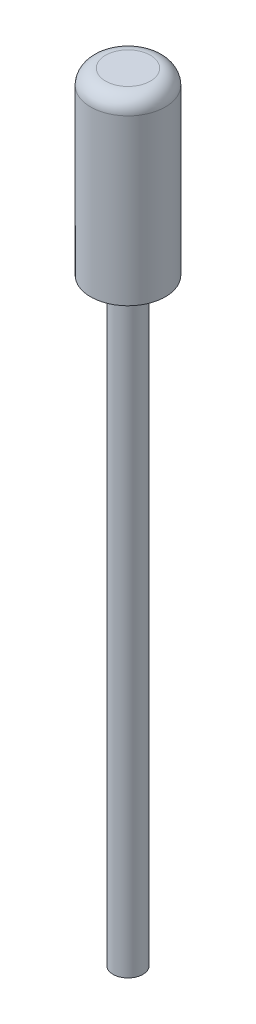
ISO-10303-21;
HEADER;
FILE_DESCRIPTION(('STEP AP214'),'2;1');
FILE_NAME('part.step','',(''),(''),'','','');
FILE_SCHEMA(('AUTOMOTIVE_DESIGN { 1 0 10303 214 1 1 1 1 }'));
ENDSEC;
DATA;
#1=APPLICATION_CONTEXT('core data for automotive mechanical design processes');
#2=APPLICATION_PROTOCOL_DEFINITION('international standard','automotive_design',2000,#1);
#3=PRODUCT_CONTEXT('',#1,'mechanical');
#4=PRODUCT('Part','Part','',(#3));
#5=PRODUCT_RELATED_PRODUCT_CATEGORY('part','',(#4));
#6=PRODUCT_DEFINITION_FORMATION('','',#4);
#7=PRODUCT_DEFINITION_CONTEXT('part definition',#1,'design');
#8=PRODUCT_DEFINITION('design','',#6,#7);
#9=PRODUCT_DEFINITION_SHAPE('','',#8);
#10=(LENGTH_UNIT() NAMED_UNIT(*) SI_UNIT(.MILLI.,.METRE.));
#11=(NAMED_UNIT(*) PLANE_ANGLE_UNIT() SI_UNIT($,.RADIAN.));
#12=(NAMED_UNIT(*) SI_UNIT($,.STERADIAN.) SOLID_ANGLE_UNIT());
#13=UNCERTAINTY_MEASURE_WITH_UNIT(LENGTH_MEASURE(1.E-05),#10,'distance_accuracy_value','');
#14=(GEOMETRIC_REPRESENTATION_CONTEXT(3) GLOBAL_UNCERTAINTY_ASSIGNED_CONTEXT((#13)) GLOBAL_UNIT_ASSIGNED_CONTEXT((#10,
#11,#12)) REPRESENTATION_CONTEXT('',''));
#15=CARTESIAN_POINT('',(0.,0.,0.));
#16=DIRECTION('',(0.,0.,1.));
#17=DIRECTION('',(1.,0.,0.));
#18=AXIS2_PLACEMENT_3D('',#15,#16,#17);
#19=CARTESIAN_POINT('',(1.49999999999999,52.,0.));
#20=DIRECTION('',(0.,-1.,0.));
#21=DIRECTION('',(1.,0.,0.));
#22=AXIS2_PLACEMENT_3D('',#19,#20,#21);
#23=PLANE('',#22);
#24=CARTESIAN_POINT('',(0.,52.,0.));
#25=DIRECTION('',(0.,1.,0.));
#26=DIRECTION('',(-1.,0.,0.));
#27=AXIS2_PLACEMENT_3D('',#24,#25,#26);
#28=CIRCLE('',#27,1.5);
#29=CARTESIAN_POINT('',(-1.50000000000001,52.,0.));
#30=VERTEX_POINT('',#29);
#31=EDGE_CURVE('E10',#30,#30,#28,.T.);
#32=ORIENTED_EDGE('',*,*,#31,.T.);
#33=EDGE_LOOP('',(#32));
#34=FACE_BOUND('',#33,.T.);
#35=ADVANCED_FACE('F37',(#34),#23,.F.);
#36=CARTESIAN_POINT('',(0.,51.,0.));
#37=DIRECTION('',(0.,1.,0.));
#38=DIRECTION('',(-1.,0.,0.));
#39=AXIS2_PLACEMENT_3D('',#36,#37,#38);
#40=TOROIDAL_SURFACE('',#39,1.5,1.);
#41=ORIENTED_EDGE('',*,*,#31,.F.);
#42=EDGE_LOOP('',(#41));
#43=FACE_BOUND('',#42,.T.);
#44=CARTESIAN_POINT('',(0.,51.,0.));
#45=DIRECTION('',(0.,1.,0.));
#46=DIRECTION('',(-1.,0.,0.));
#47=AXIS2_PLACEMENT_3D('',#44,#45,#46);
#48=CIRCLE('',#47,2.5);
#49=CARTESIAN_POINT('',(-2.50000000000001,51.,0.));
#50=VERTEX_POINT('',#49);
#51=EDGE_CURVE('E44',#50,#50,#48,.T.);
#52=ORIENTED_EDGE('',*,*,#51,.T.);
#53=EDGE_LOOP('',(#52));
#54=FACE_BOUND('',#53,.T.);
#55=ADVANCED_FACE('F77',(#43,#54),#40,.T.);
#56=CARTESIAN_POINT('',(0.,52.,0.));
#57=DIRECTION('',(0.,1.,0.));
#58=DIRECTION('',(-1.,0.,0.));
#59=AXIS2_PLACEMENT_3D('',#56,#57,#58);
#60=CYLINDRICAL_SURFACE('',#59,2.5);
#61=ORIENTED_EDGE('',*,*,#51,.F.);
#62=EDGE_LOOP('',(#61));
#63=FACE_BOUND('',#62,.T.);
#64=CARTESIAN_POINT('',(0.,40.,0.));
#65=DIRECTION('',(0.,1.,0.));
#66=DIRECTION('',(-1.,0.,0.));
#67=AXIS2_PLACEMENT_3D('',#64,#65,#66);
#68=CIRCLE('',#67,2.5);
#69=CARTESIAN_POINT('',(-2.5,40.,0.));
#70=VERTEX_POINT('',#69);
#71=EDGE_CURVE('E49',#70,#70,#68,.T.);
#72=ORIENTED_EDGE('',*,*,#71,.T.);
#73=EDGE_LOOP('',(#72));
#74=FACE_BOUND('',#73,.T.);
#75=ADVANCED_FACE('F81',(#63,#74),#60,.T.);
#76=CARTESIAN_POINT('',(1.4,40.,0.));
#77=DIRECTION('',(0.,1.,0.));
#78=DIRECTION('',(-1.,0.,0.));
#79=AXIS2_PLACEMENT_3D('',#76,#77,#78);
#80=PLANE('',#79);
#81=ORIENTED_EDGE('',*,*,#71,.F.);
#82=EDGE_LOOP('',(#81));
#83=FACE_BOUND('',#82,.T.);
#84=CARTESIAN_POINT('',(0.,40.,0.));
#85=DIRECTION('',(0.,1.,0.));
#86=DIRECTION('',(-1.,0.,0.));
#87=AXIS2_PLACEMENT_3D('',#84,#85,#86);
#88=CIRCLE('',#87,1.4);
#89=CARTESIAN_POINT('',(-1.40000000000001,40.,0.));
#90=VERTEX_POINT('',#89);
#91=EDGE_CURVE('E53',#90,#90,#88,.T.);
#92=ORIENTED_EDGE('',*,*,#91,.T.);
#93=EDGE_LOOP('',(#92));
#94=FACE_BOUND('',#93,.T.);
#95=ADVANCED_FACE('F86',(#83,#94),#80,.F.);
#96=CARTESIAN_POINT('',(0.,39.6,0.));
#97=DIRECTION('',(0.,1.,0.));
#98=DIRECTION('',(-1.,0.,0.));
#99=AXIS2_PLACEMENT_3D('',#96,#97,#98);
#100=TOROIDAL_SURFACE('',#99,1.4,0.399999999999999);
#101=ORIENTED_EDGE('',*,*,#91,.F.);
#102=EDGE_LOOP('',(#101));
#103=FACE_BOUND('',#102,.T.);
#104=CARTESIAN_POINT('',(0.,39.6,0.));
#105=DIRECTION('',(0.,1.,0.));
#106=DIRECTION('',(-1.,0.,0.));
#107=AXIS2_PLACEMENT_3D('',#104,#105,#106);
#108=CIRCLE('',#107,1.);
#109=CARTESIAN_POINT('',(-1.00000000000001,39.6,0.));
#110=VERTEX_POINT('',#109);
#111=EDGE_CURVE('E58',#110,#110,#108,.T.);
#112=ORIENTED_EDGE('',*,*,#111,.T.);
#113=EDGE_LOOP('',(#112));
#114=FACE_BOUND('',#113,.T.);
#115=ADVANCED_FACE('F73',(#103,#114),#100,.F.);
#116=CARTESIAN_POINT('',(0.,52.,0.));
#117=DIRECTION('',(0.,1.,0.));
#118=DIRECTION('',(-1.,0.,0.));
#119=AXIS2_PLACEMENT_3D('',#116,#117,#118);
#120=CYLINDRICAL_SURFACE('',#119,0.999999999999998);
#121=ORIENTED_EDGE('',*,*,#111,.F.);
#122=EDGE_LOOP('',(#121));
#123=FACE_BOUND('',#122,.T.);
#124=CARTESIAN_POINT('',(0.,0.,0.));
#125=DIRECTION('',(0.,1.,0.));
#126=DIRECTION('',(-1.,0.,0.));
#127=AXIS2_PLACEMENT_3D('',#124,#125,#126);
#128=CIRCLE('',#127,0.999999999999994);
#129=CARTESIAN_POINT('',(-0.999999999999994,0.,0.));
#130=VERTEX_POINT('',#129);
#131=EDGE_CURVE('E61',#130,#130,#128,.T.);
#132=ORIENTED_EDGE('',*,*,#131,.T.);
#133=EDGE_LOOP('',(#132));
#134=FACE_BOUND('',#133,.T.);
#135=ADVANCED_FACE('F65',(#123,#134),#120,.T.);
#136=CARTESIAN_POINT('',(0.,0.,0.));
#137=DIRECTION('',(0.,1.,0.));
#138=DIRECTION('',(-1.,0.,0.));
#139=AXIS2_PLACEMENT_3D('',#136,#137,#138);
#140=PLANE('',#139);
#141=ORIENTED_EDGE('',*,*,#131,.F.);
#142=EDGE_LOOP('',(#141));
#143=FACE_BOUND('',#142,.T.);
#144=ADVANCED_FACE('F67',(#143),#140,.F.);
#145=CLOSED_SHELL('',(#35,#55,#75,#95,#115,#135,#144));
#146=MANIFOLD_SOLID_BREP('B2',#145);
#147=ADVANCED_BREP_SHAPE_REPRESENTATION('',(#18,#146),#14);
#148=SHAPE_DEFINITION_REPRESENTATION(#9,#147);
ENDSEC;
END-ISO-10303-21;
